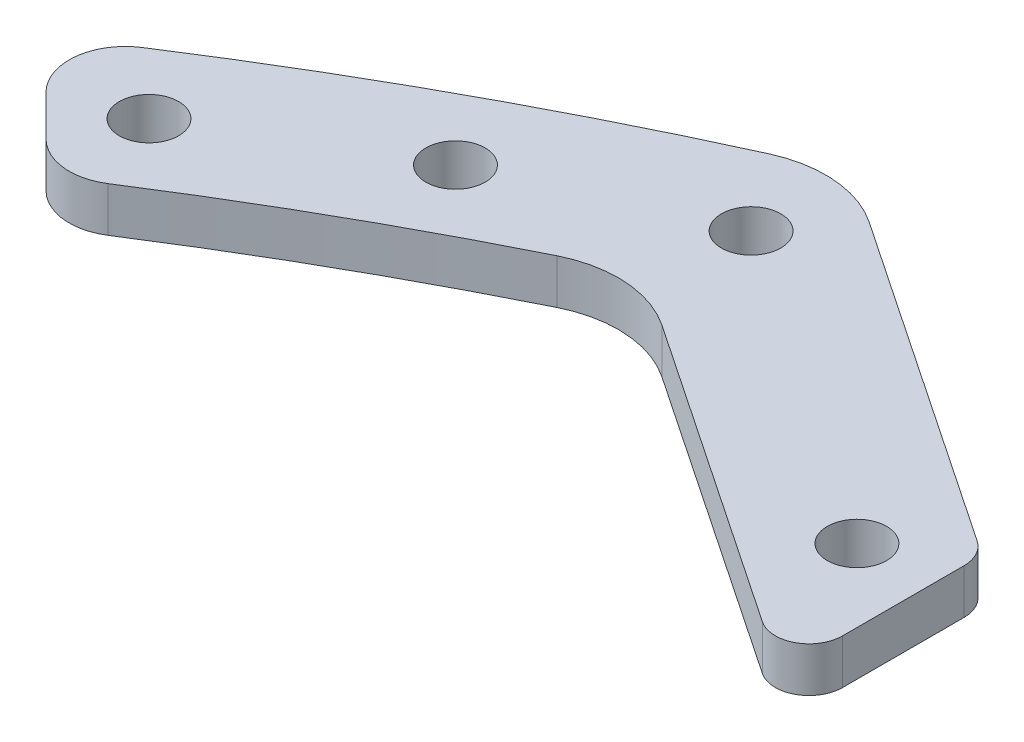
ISO-10303-21;
HEADER;
FILE_DESCRIPTION(('STEP AP214'),'2;1');
FILE_NAME('part.step','',(''),(''),'','','');
FILE_SCHEMA(('AUTOMOTIVE_DESIGN { 1 0 10303 214 1 1 1 1 }'));
ENDSEC;
DATA;
#1=APPLICATION_CONTEXT('core data for automotive mechanical design processes');
#2=APPLICATION_PROTOCOL_DEFINITION('international standard','automotive_design',2000,#1);
#3=PRODUCT_CONTEXT('',#1,'mechanical');
#4=PRODUCT('Part','Part','',(#3));
#5=PRODUCT_RELATED_PRODUCT_CATEGORY('part','',(#4));
#6=PRODUCT_DEFINITION_FORMATION('','',#4);
#7=PRODUCT_DEFINITION_CONTEXT('part definition',#1,'design');
#8=PRODUCT_DEFINITION('design','',#6,#7);
#9=PRODUCT_DEFINITION_SHAPE('','',#8);
#10=(LENGTH_UNIT() NAMED_UNIT(*) SI_UNIT(.MILLI.,.METRE.));
#11=(NAMED_UNIT(*) PLANE_ANGLE_UNIT() SI_UNIT($,.RADIAN.));
#12=(NAMED_UNIT(*) SI_UNIT($,.STERADIAN.) SOLID_ANGLE_UNIT());
#13=UNCERTAINTY_MEASURE_WITH_UNIT(LENGTH_MEASURE(1.E-05),#10,'distance_accuracy_value','');
#14=(GEOMETRIC_REPRESENTATION_CONTEXT(3) GLOBAL_UNCERTAINTY_ASSIGNED_CONTEXT((#13)) GLOBAL_UNIT_ASSIGNED_CONTEXT((#10,
#11,#12)) REPRESENTATION_CONTEXT('',''));
#15=CARTESIAN_POINT('',(0.,0.,0.));
#16=DIRECTION('',(0.,0.,1.));
#17=DIRECTION('',(1.,0.,0.));
#18=AXIS2_PLACEMENT_3D('',#15,#16,#17);
#19=CARTESIAN_POINT('',(0.,20.,0.));
#20=DIRECTION('',(0.,1.,0.));
#21=DIRECTION('',(0.,0.,1.));
#22=AXIS2_PLACEMENT_3D('',#19,#20,#21);
#23=PLANE('',#22);
#24=DIRECTION('',(0.,0.,1.));
#25=VECTOR('',#24,1.);
#26=CARTESIAN_POINT('',(-75.1398875240773,20.,-233.453053870638));
#27=LINE('',#26,#25);
#28=CARTESIAN_POINT('',(-75.1398875240773,20.,-231.855762431612));
#29=VERTEX_POINT('',#28);
#30=CARTESIAN_POINT('',(-75.1398875240773,20.,-221.008017625354));
#31=VERTEX_POINT('',#30);
#32=EDGE_CURVE('E253',#29,#31,#27,.T.);
#33=ORIENTED_EDGE('',*,*,#32,.F.);
#34=CARTESIAN_POINT('',(-78.1398875240773,20.,-231.855762431612));
#35=DIRECTION('',(0.,1.,0.));
#36=DIRECTION('',(0.,0.,1.));
#37=AXIS2_PLACEMENT_3D('',#34,#35,#36);
#38=CIRCLE('',#37,3.);
#39=CARTESIAN_POINT('',(-76.4651051806493,20.,-234.344759037102));
#40=VERTEX_POINT('',#39);
#41=EDGE_CURVE('E238',#29,#40,#38,.T.);
#42=ORIENTED_EDGE('',*,*,#41,.T.);
#43=DIRECTION('',(-0.829665535163396,0.,-0.55826078114268));
#44=VECTOR('',#43,1.);
#45=CARTESIAN_POINT('',(-110.52513989388,20.,-257.262887823794));
#46=LINE('',#45,#44);
#47=CARTESIAN_POINT('',(-105.949454728796,20.,-254.184025961683));
#48=VERTEX_POINT('',#47);
#49=EDGE_CURVE('E197',#40,#48,#46,.T.);
#50=ORIENTED_EDGE('',*,*,#49,.T.);
#51=CARTESIAN_POINT('',(-111.532062540223,20.,-245.887370610049));
#52=DIRECTION('',(0.,1.,0.));
#53=DIRECTION('',(0.,0.,1.));
#54=AXIS2_PLACEMENT_3D('',#51,#52,#53);
#55=CIRCLE('',#54,10.);
#56=CARTESIAN_POINT('',(-115.662879671342,20.,-254.994310262273));
#57=VERTEX_POINT('',#56);
#58=EDGE_CURVE('E201',#48,#57,#55,.T.);
#59=ORIENTED_EDGE('',*,*,#58,.T.);
#60=CARTESIAN_POINT('',(0.,20.,0.));
#61=DIRECTION('',(0.,1.,0.));
#62=DIRECTION('',(0.,0.,1.));
#63=AXIS2_PLACEMENT_3D('',#60,#61,#62);
#64=CIRCLE('',#63,280.);
#65=CARTESIAN_POINT('',(-151.898531332941,20.,-235.216572925667));
#66=VERTEX_POINT('',#65);
#67=EDGE_CURVE('E148',#57,#66,#64,.T.);
#68=ORIENTED_EDGE('',*,*,#67,.T.);
#69=CARTESIAN_POINT('',(-149.186057559138,20.,-231.016276980566));
#70=DIRECTION('',(0.,1.,0.));
#71=DIRECTION('',(0.,0.,1.));
#72=AXIS2_PLACEMENT_3D('',#69,#70,#71);
#73=CIRCLE('',#72,5.);
#74=CARTESIAN_POINT('',(-152.721591465071,20.,-227.480743074633));
#75=VERTEX_POINT('',#74);
#76=EDGE_CURVE('E217',#66,#75,#73,.T.);
#77=ORIENTED_EDGE('',*,*,#76,.T.);
#78=DIRECTION('',(0.707106781186547,0.,0.707106781186548));
#79=VECTOR('',#78,1.);
#80=CARTESIAN_POINT('',(-157.049761777423,20.,-231.808913386985));
#81=LINE('',#80,#79);
#82=CARTESIAN_POINT('',(-149.103543531421,20.,-223.862695140983));
#83=VERTEX_POINT('',#82);
#84=EDGE_CURVE('E176',#75,#83,#81,.T.);
#85=ORIENTED_EDGE('',*,*,#84,.T.);
#86=CARTESIAN_POINT('',(-145.568009625488,20.,-227.398229046916));
#87=DIRECTION('',(0.,1.,0.));
#88=DIRECTION('',(0.,0.,1.));
#89=AXIS2_PLACEMENT_3D('',#86,#87,#88);
#90=CIRCLE('',#89,5.);
#91=CARTESIAN_POINT('',(-142.872305743535,20.,-223.187150731232));
#92=VERTEX_POINT('',#91);
#93=EDGE_CURVE('E215',#83,#92,#90,.T.);
#94=ORIENTED_EDGE('',*,*,#93,.T.);
#95=CARTESIAN_POINT('',(0.,20.,0.));
#96=DIRECTION('',(0.,1.,0.));
#97=DIRECTION('',(0.,0.,1.));
#98=AXIS2_PLACEMENT_3D('',#95,#96,#97);
#99=CIRCLE('',#98,265.);
#100=CARTESIAN_POINT('',(-117.253390888974,20.,-237.648148162441));
#101=VERTEX_POINT('',#100);
#102=EDGE_CURVE('E193',#101,#92,#99,.T.);
#103=ORIENTED_EDGE('',*,*,#102,.F.);
#104=CARTESIAN_POINT('',(-112.828734629012,20.,-228.680293514802));
#105=DIRECTION('',(0.,1.,0.));
#106=DIRECTION('',(0.,0.,1.));
#107=AXIS2_PLACEMENT_3D('',#104,#105,#106);
#108=CIRCLE('',#107,10.);
#109=CARTESIAN_POINT('',(-107.246126817586,20.,-236.976948866436));
#110=VERTEX_POINT('',#109);
#111=EDGE_CURVE('E210',#101,#110,#108,.F.);
#112=ORIENTED_EDGE('',*,*,#111,.T.);
#113=DIRECTION('',(-0.829665535163396,0.,-0.55826078114268));
#114=VECTOR('',#113,1.);
#115=CARTESIAN_POINT('',(-111.993839361285,20.,-240.171563564712));
#116=LINE('',#115,#114);
#117=CARTESIAN_POINT('',(-79.8146698675053,20.,-218.519021019864));
#118=VERTEX_POINT('',#117);
#119=EDGE_CURVE('E191',#118,#110,#116,.T.);
#120=ORIENTED_EDGE('',*,*,#119,.F.);
#121=CARTESIAN_POINT('',(-78.1398875240773,20.,-221.008017625354));
#122=DIRECTION('',(0.,1.,0.));
#123=DIRECTION('',(0.,0.,1.));
#124=AXIS2_PLACEMENT_3D('',#121,#122,#123);
#125=CIRCLE('',#124,3.);
#126=EDGE_CURVE('E236',#118,#31,#125,.T.);
#127=ORIENTED_EDGE('',*,*,#126,.T.);
#128=EDGE_LOOP('',(#33,#42,#50,#59,#68,#77,#85,#94,#103,#112,#120,#127));
#129=FACE_BOUND('',#128,.T.);
#130=CARTESIAN_POINT('',(-146.077022116924,20.,-230.028561881911));
#131=DIRECTION('',(0.,1.,0.));
#132=DIRECTION('',(0.,0.,1.));
#133=AXIS2_PLACEMENT_3D('',#130,#131,#132);
#134=CIRCLE('',#133,2.65000000000002);
#135=CARTESIAN_POINT('',(-146.077022116924,20.,-227.378561881911));
#136=VERTEX_POINT('',#135);
#137=EDGE_CURVE('E179',#136,#136,#134,.T.);
#138=ORIENTED_EDGE('',*,*,#137,.F.);
#139=EDGE_LOOP('',(#138));
#140=FACE_BOUND('',#139,.T.);
#141=CARTESIAN_POINT('',(-128.811575357983,20.,-240.123330240531));
#142=DIRECTION('',(0.,1.,0.));
#143=DIRECTION('',(0.,0.,1.));
#144=AXIS2_PLACEMENT_3D('',#141,#142,#143);
#145=CIRCLE('',#144,2.65000000000002);
#146=CARTESIAN_POINT('',(-128.811575357983,20.,-237.473330240531));
#147=VERTEX_POINT('',#146);
#148=EDGE_CURVE('E184',#147,#147,#145,.T.);
#149=ORIENTED_EDGE('',*,*,#148,.F.);
#150=EDGE_LOOP('',(#149));
#151=FACE_BOUND('',#150,.T.);
#152=CARTESIAN_POINT('',(-81.6398875240773,20.,-228.786950774274));
#153=DIRECTION('',(0.,1.,0.));
#154=DIRECTION('',(0.,0.,1.));
#155=AXIS2_PLACEMENT_3D('',#152,#153,#154);
#156=CIRCLE('',#155,2.65);
#157=CARTESIAN_POINT('',(-81.6398875240773,20.,-226.136950774274));
#158=VERTEX_POINT('',#157);
#159=EDGE_CURVE('E180',#158,#158,#156,.T.);
#160=ORIENTED_EDGE('',*,*,#159,.F.);
#161=EDGE_LOOP('',(#160));
#162=FACE_BOUND('',#161,.T.);
#163=CARTESIAN_POINT('',(-110.52513989388,20.,-248.223100485246));
#164=DIRECTION('',(0.,1.,0.));
#165=DIRECTION('',(0.,0.,1.));
#166=AXIS2_PLACEMENT_3D('',#163,#164,#165);
#167=CIRCLE('',#166,2.65);
#168=CARTESIAN_POINT('',(-110.52513989388,20.,-245.573100485246));
#169=VERTEX_POINT('',#168);
#170=EDGE_CURVE('E183',#169,#169,#167,.T.);
#171=ORIENTED_EDGE('',*,*,#170,.F.);
#172=EDGE_LOOP('',(#171));
#173=FACE_BOUND('',#172,.T.);
#174=ADVANCED_FACE('F39',(#129,#140,#151,#162,#173),#23,.T.);
#175=CARTESIAN_POINT('',(0.,20.,0.));
#176=DIRECTION('',(0.,-1.,0.));
#177=DIRECTION('',(0.,0.,-1.));
#178=AXIS2_PLACEMENT_3D('',#175,#176,#177);
#179=CYLINDRICAL_SURFACE('',#178,280.);
#180=CARTESIAN_POINT('',(0.,16.,0.));
#181=DIRECTION('',(0.,1.,0.));
#182=DIRECTION('',(0.,0.,1.));
#183=AXIS2_PLACEMENT_3D('',#180,#181,#182);
#184=CIRCLE('',#183,280.);
#185=CARTESIAN_POINT('',(-115.662879671342,16.,-254.994310262273));
#186=VERTEX_POINT('',#185);
#187=CARTESIAN_POINT('',(-151.898531332941,16.,-235.216572925667));
#188=VERTEX_POINT('',#187);
#189=EDGE_CURVE('E145',#186,#188,#184,.T.);
#190=ORIENTED_EDGE('',*,*,#189,.T.);
#191=DIRECTION('',(0.,-1.,0.));
#192=VECTOR('',#191,1.);
#193=CARTESIAN_POINT('',(-151.898531332941,20.,-235.216572925667));
#194=LINE('',#193,#192);
#195=EDGE_CURVE('E213',#188,#66,#194,.F.);
#196=ORIENTED_EDGE('',*,*,#195,.T.);
#197=ORIENTED_EDGE('',*,*,#67,.F.);
#198=DIRECTION('',(0.,-1.,0.));
#199=VECTOR('',#198,1.);
#200=CARTESIAN_POINT('',(-115.662879671342,20.,-254.994310262273));
#201=LINE('',#200,#199);
#202=EDGE_CURVE('E135',#57,#186,#201,.T.);
#203=ORIENTED_EDGE('',*,*,#202,.T.);
#204=EDGE_LOOP('',(#190,#196,#197,#203));
#205=FACE_BOUND('',#204,.T.);
#206=ADVANCED_FACE('F143',(#205),#179,.T.);
#207=CARTESIAN_POINT('',(-110.52513989388,20.,-257.262887823794));
#208=DIRECTION('',(-0.55826078114268,0.,0.829665535163396));
#209=DIRECTION('',(0.829665535163396,0.,0.55826078114268));
#210=AXIS2_PLACEMENT_3D('',#207,#208,#209);
#211=PLANE('',#210);
#212=ORIENTED_EDGE('',*,*,#49,.F.);
#213=DIRECTION('',(0.,1.,0.));
#214=VECTOR('',#213,1.);
#215=CARTESIAN_POINT('',(-76.4651051806493,20.,-234.344759037102));
#216=LINE('',#215,#214);
#217=CARTESIAN_POINT('',(-76.4651051806493,16.,-234.344759037102));
#218=VERTEX_POINT('',#217);
#219=EDGE_CURVE('E62',#40,#218,#216,.F.);
#220=ORIENTED_EDGE('',*,*,#219,.T.);
#221=DIRECTION('',(-0.829665535163396,0.,-0.55826078114268));
#222=VECTOR('',#221,1.);
#223=CARTESIAN_POINT('',(-110.52513989388,16.,-257.262887823794));
#224=LINE('',#223,#222);
#225=CARTESIAN_POINT('',(-105.949454728796,16.,-254.184025961683));
#226=VERTEX_POINT('',#225);
#227=EDGE_CURVE('E156',#218,#226,#224,.T.);
#228=ORIENTED_EDGE('',*,*,#227,.T.);
#229=DIRECTION('',(0.,-1.,0.));
#230=VECTOR('',#229,1.);
#231=CARTESIAN_POINT('',(-105.949454728796,20.,-254.184025961683));
#232=LINE('',#231,#230);
#233=EDGE_CURVE('E137',#226,#48,#232,.F.);
#234=ORIENTED_EDGE('',*,*,#233,.T.);
#235=EDGE_LOOP('',(#212,#220,#228,#234));
#236=FACE_BOUND('',#235,.T.);
#237=ADVANCED_FACE('F254',(#236),#211,.F.);
#238=CARTESIAN_POINT('',(-111.993839361285,20.,-240.171563564712));
#239=DIRECTION('',(-0.55826078114268,0.,0.829665535163396));
#240=DIRECTION('',(0.829665535163396,0.,0.55826078114268));
#241=AXIS2_PLACEMENT_3D('',#238,#239,#240);
#242=PLANE('',#241);
#243=DIRECTION('',(-0.829665535163396,0.,-0.55826078114268));
#244=VECTOR('',#243,1.);
#245=CARTESIAN_POINT('',(-111.993839361285,16.,-240.171563564712));
#246=LINE('',#245,#244);
#247=CARTESIAN_POINT('',(-79.8146698675053,16.,-218.519021019864));
#248=VERTEX_POINT('',#247);
#249=CARTESIAN_POINT('',(-107.246126817586,16.,-236.976948866436));
#250=VERTEX_POINT('',#249);
#251=EDGE_CURVE('E157',#248,#250,#246,.T.);
#252=ORIENTED_EDGE('',*,*,#251,.F.);
#253=DIRECTION('',(0.,1.,0.));
#254=VECTOR('',#253,1.);
#255=CARTESIAN_POINT('',(-79.8146698675053,20.,-218.519021019864));
#256=LINE('',#255,#254);
#257=EDGE_CURVE('E12',#248,#118,#256,.T.);
#258=ORIENTED_EDGE('',*,*,#257,.T.);
#259=ORIENTED_EDGE('',*,*,#119,.T.);
#260=DIRECTION('',(0.,1.,0.));
#261=VECTOR('',#260,1.);
#262=CARTESIAN_POINT('',(-107.246126817586,16.,-236.976948866436));
#263=LINE('',#262,#261);
#264=EDGE_CURVE('E203',#110,#250,#263,.F.);
#265=ORIENTED_EDGE('',*,*,#264,.T.);
#266=EDGE_LOOP('',(#252,#258,#259,#265));
#267=FACE_BOUND('',#266,.T.);
#268=ADVANCED_FACE('F284',(#267),#242,.T.);
#269=CARTESIAN_POINT('',(0.,20.,0.));
#270=DIRECTION('',(0.,-1.,0.));
#271=DIRECTION('',(0.,0.,-1.));
#272=AXIS2_PLACEMENT_3D('',#269,#270,#271);
#273=CYLINDRICAL_SURFACE('',#272,265.);
#274=ORIENTED_EDGE('',*,*,#102,.T.);
#275=DIRECTION('',(0.,-1.,0.));
#276=VECTOR('',#275,1.);
#277=CARTESIAN_POINT('',(-142.872305743535,20.,-223.187150731232));
#278=LINE('',#277,#276);
#279=CARTESIAN_POINT('',(-142.872305743535,16.,-223.187150731232));
#280=VERTEX_POINT('',#279);
#281=EDGE_CURVE('E226',#92,#280,#278,.T.);
#282=ORIENTED_EDGE('',*,*,#281,.T.);
#283=CARTESIAN_POINT('',(0.,16.,0.));
#284=DIRECTION('',(0.,1.,0.));
#285=DIRECTION('',(0.,0.,1.));
#286=AXIS2_PLACEMENT_3D('',#283,#284,#285);
#287=CIRCLE('',#286,265.);
#288=CARTESIAN_POINT('',(-117.253390888974,16.,-237.648148162441));
#289=VERTEX_POINT('',#288);
#290=EDGE_CURVE('E161',#289,#280,#287,.T.);
#291=ORIENTED_EDGE('',*,*,#290,.F.);
#292=DIRECTION('',(0.,-1.,0.));
#293=VECTOR('',#292,1.);
#294=CARTESIAN_POINT('',(-117.253390888974,20.,-237.648148162441));
#295=LINE('',#294,#293);
#296=EDGE_CURVE('E206',#289,#101,#295,.F.);
#297=ORIENTED_EDGE('',*,*,#296,.T.);
#298=EDGE_LOOP('',(#274,#282,#291,#297));
#299=FACE_BOUND('',#298,.T.);
#300=ADVANCED_FACE('F313',(#299),#273,.F.);
#301=CARTESIAN_POINT('',(-146.077022116924,0.,-230.028561881911));
#302=DIRECTION('',(0.,1.,0.));
#303=DIRECTION('',(0.,0.,1.));
#304=AXIS2_PLACEMENT_3D('',#301,#302,#303);
#305=CYLINDRICAL_SURFACE('',#304,2.65000000000002);
#306=CARTESIAN_POINT('',(-146.077022116924,16.,-230.028561881911));
#307=DIRECTION('',(0.,1.,0.));
#308=DIRECTION('',(0.,0.,1.));
#309=AXIS2_PLACEMENT_3D('',#306,#307,#308);
#310=CIRCLE('',#309,2.65000000000002);
#311=CARTESIAN_POINT('',(-146.077022116924,16.,-227.378561881911));
#312=VERTEX_POINT('',#311);
#313=EDGE_CURVE('E173',#312,#312,#310,.F.);
#314=ORIENTED_EDGE('',*,*,#313,.T.);
#315=EDGE_LOOP('',(#314));
#316=FACE_BOUND('',#315,.T.);
#317=ORIENTED_EDGE('',*,*,#137,.T.);
#318=EDGE_LOOP('',(#317));
#319=FACE_BOUND('',#318,.T.);
#320=ADVANCED_FACE('F309',(#316,#319),#305,.F.);
#321=CARTESIAN_POINT('',(-128.811575357983,0.,-240.123330240531));
#322=DIRECTION('',(0.,1.,0.));
#323=DIRECTION('',(0.,0.,1.));
#324=AXIS2_PLACEMENT_3D('',#321,#322,#323);
#325=CYLINDRICAL_SURFACE('',#324,2.65000000000002);
#326=CARTESIAN_POINT('',(-128.811575357983,16.,-240.123330240531));
#327=DIRECTION('',(0.,1.,0.));
#328=DIRECTION('',(0.,0.,1.));
#329=AXIS2_PLACEMENT_3D('',#326,#327,#328);
#330=CIRCLE('',#329,2.65000000000002);
#331=CARTESIAN_POINT('',(-128.811575357983,16.,-237.473330240531));
#332=VERTEX_POINT('',#331);
#333=EDGE_CURVE('E170',#332,#332,#330,.F.);
#334=ORIENTED_EDGE('',*,*,#333,.T.);
#335=EDGE_LOOP('',(#334));
#336=FACE_BOUND('',#335,.T.);
#337=ORIENTED_EDGE('',*,*,#148,.T.);
#338=EDGE_LOOP('',(#337));
#339=FACE_BOUND('',#338,.T.);
#340=ADVANCED_FACE('F305',(#336,#339),#325,.F.);
#341=CARTESIAN_POINT('',(-81.6398875240773,0.,-228.786950774274));
#342=DIRECTION('',(0.,1.,0.));
#343=DIRECTION('',(0.,0.,1.));
#344=AXIS2_PLACEMENT_3D('',#341,#342,#343);
#345=CYLINDRICAL_SURFACE('',#344,2.65);
#346=CARTESIAN_POINT('',(-81.6398875240773,16.,-228.786950774274));
#347=DIRECTION('',(0.,1.,0.));
#348=DIRECTION('',(0.,0.,1.));
#349=AXIS2_PLACEMENT_3D('',#346,#347,#348);
#350=CIRCLE('',#349,2.65);
#351=CARTESIAN_POINT('',(-81.6398875240773,16.,-226.136950774274));
#352=VERTEX_POINT('',#351);
#353=EDGE_CURVE('E167',#352,#352,#350,.F.);
#354=ORIENTED_EDGE('',*,*,#353,.T.);
#355=EDGE_LOOP('',(#354));
#356=FACE_BOUND('',#355,.T.);
#357=ORIENTED_EDGE('',*,*,#159,.T.);
#358=EDGE_LOOP('',(#357));
#359=FACE_BOUND('',#358,.T.);
#360=ADVANCED_FACE('F302',(#356,#359),#345,.F.);
#361=CARTESIAN_POINT('',(-110.52513989388,0.,-248.223100485246));
#362=DIRECTION('',(0.,1.,0.));
#363=DIRECTION('',(0.,0.,1.));
#364=AXIS2_PLACEMENT_3D('',#361,#362,#363);
#365=CYLINDRICAL_SURFACE('',#364,2.65);
#366=CARTESIAN_POINT('',(-110.52513989388,16.,-248.223100485246));
#367=DIRECTION('',(0.,1.,0.));
#368=DIRECTION('',(0.,0.,1.));
#369=AXIS2_PLACEMENT_3D('',#366,#367,#368);
#370=CIRCLE('',#369,2.65);
#371=CARTESIAN_POINT('',(-110.52513989388,16.,-245.573100485246));
#372=VERTEX_POINT('',#371);
#373=EDGE_CURVE('E159',#372,#372,#370,.F.);
#374=ORIENTED_EDGE('',*,*,#373,.T.);
#375=EDGE_LOOP('',(#374));
#376=FACE_BOUND('',#375,.T.);
#377=ORIENTED_EDGE('',*,*,#170,.T.);
#378=EDGE_LOOP('',(#377));
#379=FACE_BOUND('',#378,.T.);
#380=ADVANCED_FACE('F297',(#376,#379),#365,.F.);
#381=CARTESIAN_POINT('',(-157.049761777423,0.,-231.808913386985));
#382=DIRECTION('',(-0.707106781186548,0.,0.707106781186547));
#383=DIRECTION('',(0.707106781186547,0.,0.707106781186548));
#384=AXIS2_PLACEMENT_3D('',#381,#382,#383);
#385=PLANE('',#384);
#386=ORIENTED_EDGE('',*,*,#84,.F.);
#387=DIRECTION('',(0.,1.,0.));
#388=VECTOR('',#387,1.);
#389=CARTESIAN_POINT('',(-152.721591465071,16.,-227.480743074633));
#390=LINE('',#389,#388);
#391=CARTESIAN_POINT('',(-152.721591465071,16.,-227.480743074633));
#392=VERTEX_POINT('',#391);
#393=EDGE_CURVE('E221',#75,#392,#390,.F.);
#394=ORIENTED_EDGE('',*,*,#393,.T.);
#395=DIRECTION('',(-0.707106781186547,0.,-0.707106781186548));
#396=VECTOR('',#395,1.);
#397=CARTESIAN_POINT('',(-157.049761777423,16.,-231.808913386985));
#398=LINE('',#397,#396);
#399=CARTESIAN_POINT('',(-149.103543531421,16.,-223.862695140983));
#400=VERTEX_POINT('',#399);
#401=EDGE_CURVE('E149',#400,#392,#398,.T.);
#402=ORIENTED_EDGE('',*,*,#401,.F.);
#403=DIRECTION('',(0.,-1.,0.));
#404=VECTOR('',#403,1.);
#405=CARTESIAN_POINT('',(-149.103543531421,0.,-223.862695140983));
#406=LINE('',#405,#404);
#407=EDGE_CURVE('E219',#400,#83,#406,.F.);
#408=ORIENTED_EDGE('',*,*,#407,.T.);
#409=EDGE_LOOP('',(#386,#394,#402,#408));
#410=FACE_BOUND('',#409,.T.);
#411=ADVANCED_FACE('F260',(#410),#385,.T.);
#412=CARTESIAN_POINT('',(-12.8601109308035,16.,-468.693727866374));
#413=DIRECTION('',(0.,1.,0.));
#414=DIRECTION('',(0.,0.,1.));
#415=AXIS2_PLACEMENT_3D('',#412,#413,#414);
#416=PLANE('',#415);
#417=ORIENTED_EDGE('',*,*,#333,.F.);
#418=EDGE_LOOP('',(#417));
#419=FACE_BOUND('',#418,.T.);
#420=ORIENTED_EDGE('',*,*,#227,.F.);
#421=CARTESIAN_POINT('',(-78.1398875240773,16.,-231.855762431612));
#422=DIRECTION('',(0.,1.,0.));
#423=DIRECTION('',(0.,0.,1.));
#424=AXIS2_PLACEMENT_3D('',#421,#422,#423);
#425=CIRCLE('',#424,3.);
#426=CARTESIAN_POINT('',(-75.1398875240773,16.,-231.855762431612));
#427=VERTEX_POINT('',#426);
#428=EDGE_CURVE('E47',#218,#427,#425,.F.);
#429=ORIENTED_EDGE('',*,*,#428,.T.);
#430=DIRECTION('',(0.,0.,1.));
#431=VECTOR('',#430,1.);
#432=CARTESIAN_POINT('',(-75.1398875240773,16.,-468.693727866374));
#433=LINE('',#432,#431);
#434=CARTESIAN_POINT('',(-75.1398875240773,16.,-221.008017625354));
#435=VERTEX_POINT('',#434);
#436=EDGE_CURVE('E229',#427,#435,#433,.T.);
#437=ORIENTED_EDGE('',*,*,#436,.T.);
#438=CARTESIAN_POINT('',(-78.1398875240773,16.,-221.008017625354));
#439=DIRECTION('',(0.,1.,0.));
#440=DIRECTION('',(0.,0.,1.));
#441=AXIS2_PLACEMENT_3D('',#438,#439,#440);
#442=CIRCLE('',#441,3.);
#443=EDGE_CURVE('E54',#435,#248,#442,.F.);
#444=ORIENTED_EDGE('',*,*,#443,.T.);
#445=ORIENTED_EDGE('',*,*,#251,.T.);
#446=CARTESIAN_POINT('',(-112.828734629012,16.,-228.680293514802));
#447=DIRECTION('',(0.,1.,0.));
#448=DIRECTION('',(0.,0.,1.));
#449=AXIS2_PLACEMENT_3D('',#446,#447,#448);
#450=CIRCLE('',#449,10.);
#451=EDGE_CURVE('E208',#250,#289,#450,.T.);
#452=ORIENTED_EDGE('',*,*,#451,.T.);
#453=ORIENTED_EDGE('',*,*,#290,.T.);
#454=CARTESIAN_POINT('',(-145.568009625488,16.,-227.398229046916));
#455=DIRECTION('',(0.,1.,0.));
#456=DIRECTION('',(0.,0.,1.));
#457=AXIS2_PLACEMENT_3D('',#454,#455,#456);
#458=CIRCLE('',#457,5.);
#459=EDGE_CURVE('E223',#280,#400,#458,.F.);
#460=ORIENTED_EDGE('',*,*,#459,.T.);
#461=ORIENTED_EDGE('',*,*,#401,.T.);
#462=CARTESIAN_POINT('',(-149.186057559138,16.,-231.016276980566));
#463=DIRECTION('',(0.,1.,0.));
#464=DIRECTION('',(0.,0.,1.));
#465=AXIS2_PLACEMENT_3D('',#462,#463,#464);
#466=CIRCLE('',#465,5.);
#467=EDGE_CURVE('E155',#392,#188,#466,.F.);
#468=ORIENTED_EDGE('',*,*,#467,.T.);
#469=ORIENTED_EDGE('',*,*,#189,.F.);
#470=CARTESIAN_POINT('',(-111.532062540223,16.,-245.887370610049));
#471=DIRECTION('',(0.,1.,0.));
#472=DIRECTION('',(0.,0.,1.));
#473=AXIS2_PLACEMENT_3D('',#470,#471,#472);
#474=CIRCLE('',#473,10.);
#475=EDGE_CURVE('E131',#186,#226,#474,.F.);
#476=ORIENTED_EDGE('',*,*,#475,.T.);
#477=EDGE_LOOP('',(#420,#429,#437,#444,#445,#452,#453,#460,#461,#468,#469,#476));
#478=FACE_BOUND('',#477,.T.);
#479=ORIENTED_EDGE('',*,*,#373,.F.);
#480=EDGE_LOOP('',(#479));
#481=FACE_BOUND('',#480,.T.);
#482=ORIENTED_EDGE('',*,*,#353,.F.);
#483=EDGE_LOOP('',(#482));
#484=FACE_BOUND('',#483,.T.);
#485=ORIENTED_EDGE('',*,*,#313,.F.);
#486=EDGE_LOOP('',(#485));
#487=FACE_BOUND('',#486,.T.);
#488=ADVANCED_FACE('F151',(#419,#478,#481,#484,#487),#416,.F.);
#489=CARTESIAN_POINT('',(-111.532062540223,20.,-245.887370610049));
#490=DIRECTION('',(0.,-1.,0.));
#491=DIRECTION('',(0.,0.,-1.));
#492=AXIS2_PLACEMENT_3D('',#489,#490,#491);
#493=CYLINDRICAL_SURFACE('',#492,10.);
#494=ORIENTED_EDGE('',*,*,#58,.F.);
#495=ORIENTED_EDGE('',*,*,#233,.F.);
#496=ORIENTED_EDGE('',*,*,#475,.F.);
#497=ORIENTED_EDGE('',*,*,#202,.F.);
#498=EDGE_LOOP('',(#494,#495,#496,#497));
#499=FACE_BOUND('',#498,.T.);
#500=ADVANCED_FACE('F134',(#499),#493,.T.);
#501=CARTESIAN_POINT('',(-112.828734629012,20.,-228.680293514802));
#502=DIRECTION('',(0.,-1.,0.));
#503=DIRECTION('',(0.,0.,-1.));
#504=AXIS2_PLACEMENT_3D('',#501,#502,#503);
#505=CYLINDRICAL_SURFACE('',#504,10.);
#506=ORIENTED_EDGE('',*,*,#111,.F.);
#507=ORIENTED_EDGE('',*,*,#296,.F.);
#508=ORIENTED_EDGE('',*,*,#451,.F.);
#509=ORIENTED_EDGE('',*,*,#264,.F.);
#510=EDGE_LOOP('',(#506,#507,#508,#509));
#511=FACE_BOUND('',#510,.T.);
#512=ADVANCED_FACE('F266',(#511),#505,.F.);
#513=CARTESIAN_POINT('',(-149.186057559138,20.,-231.016276980566));
#514=DIRECTION('',(0.,-1.,0.));
#515=DIRECTION('',(0.,0.,-1.));
#516=AXIS2_PLACEMENT_3D('',#513,#514,#515);
#517=CYLINDRICAL_SURFACE('',#516,5.);
#518=ORIENTED_EDGE('',*,*,#467,.F.);
#519=ORIENTED_EDGE('',*,*,#393,.F.);
#520=ORIENTED_EDGE('',*,*,#76,.F.);
#521=ORIENTED_EDGE('',*,*,#195,.F.);
#522=EDGE_LOOP('',(#518,#519,#520,#521));
#523=FACE_BOUND('',#522,.T.);
#524=ADVANCED_FACE('F263',(#523),#517,.T.);
#525=CARTESIAN_POINT('',(-145.568009625488,20.,-227.398229046916));
#526=DIRECTION('',(0.,-1.,0.));
#527=DIRECTION('',(0.,0.,-1.));
#528=AXIS2_PLACEMENT_3D('',#525,#526,#527);
#529=CYLINDRICAL_SURFACE('',#528,5.);
#530=ORIENTED_EDGE('',*,*,#93,.F.);
#531=ORIENTED_EDGE('',*,*,#407,.F.);
#532=ORIENTED_EDGE('',*,*,#459,.F.);
#533=ORIENTED_EDGE('',*,*,#281,.F.);
#534=EDGE_LOOP('',(#530,#531,#532,#533));
#535=FACE_BOUND('',#534,.T.);
#536=ADVANCED_FACE('F265',(#535),#529,.T.);
#537=CARTESIAN_POINT('',(-75.1398875240773,10.,-233.453053870638));
#538=DIRECTION('',(-1.,0.,0.));
#539=DIRECTION('',(0.,0.,1.));
#540=AXIS2_PLACEMENT_3D('',#537,#538,#539);
#541=PLANE('',#540);
#542=ORIENTED_EDGE('',*,*,#436,.F.);
#543=DIRECTION('',(0.,1.,0.));
#544=VECTOR('',#543,1.);
#545=CARTESIAN_POINT('',(-75.1398875240773,10.,-231.855762431612));
#546=LINE('',#545,#544);
#547=EDGE_CURVE('E233',#427,#29,#546,.T.);
#548=ORIENTED_EDGE('',*,*,#547,.T.);
#549=ORIENTED_EDGE('',*,*,#32,.T.);
#550=DIRECTION('',(0.,1.,0.));
#551=VECTOR('',#550,1.);
#552=CARTESIAN_POINT('',(-75.1398875240773,16.,-221.008017625354));
#553=LINE('',#552,#551);
#554=EDGE_CURVE('E231',#31,#435,#553,.F.);
#555=ORIENTED_EDGE('',*,*,#554,.T.);
#556=EDGE_LOOP('',(#542,#548,#549,#555));
#557=FACE_BOUND('',#556,.T.);
#558=ADVANCED_FACE('F246',(#557),#541,.F.);
#559=CARTESIAN_POINT('',(-78.1398875240773,10.,-231.855762431612));
#560=DIRECTION('',(0.,1.,0.));
#561=DIRECTION('',(0.,0.,1.));
#562=AXIS2_PLACEMENT_3D('',#559,#560,#561);
#563=CYLINDRICAL_SURFACE('',#562,3.);
#564=ORIENTED_EDGE('',*,*,#428,.F.);
#565=ORIENTED_EDGE('',*,*,#219,.F.);
#566=ORIENTED_EDGE('',*,*,#41,.F.);
#567=ORIENTED_EDGE('',*,*,#547,.F.);
#568=EDGE_LOOP('',(#564,#565,#566,#567));
#569=FACE_BOUND('',#568,.T.);
#570=ADVANCED_FACE('F250',(#569),#563,.T.);
#571=CARTESIAN_POINT('',(-78.1398875240773,20.,-221.008017625354));
#572=DIRECTION('',(0.,-1.,0.));
#573=DIRECTION('',(0.,0.,-1.));
#574=AXIS2_PLACEMENT_3D('',#571,#572,#573);
#575=CYLINDRICAL_SURFACE('',#574,3.);
#576=ORIENTED_EDGE('',*,*,#443,.F.);
#577=ORIENTED_EDGE('',*,*,#554,.F.);
#578=ORIENTED_EDGE('',*,*,#126,.F.);
#579=ORIENTED_EDGE('',*,*,#257,.F.);
#580=EDGE_LOOP('',(#576,#577,#578,#579));
#581=FACE_BOUND('',#580,.T.);
#582=ADVANCED_FACE('F41',(#581),#575,.T.);
#583=CLOSED_SHELL('',(#174,#206,#237,#268,#300,#320,#340,#360,#380,#411,#488,#500,#512,#524,
#536,#558,#570,#582));
#584=MANIFOLD_SOLID_BREP('B2',#583);
#585=ADVANCED_BREP_SHAPE_REPRESENTATION('',(#18,#584),#14);
#586=SHAPE_DEFINITION_REPRESENTATION(#9,#585);
ENDSEC;
END-ISO-10303-21;
